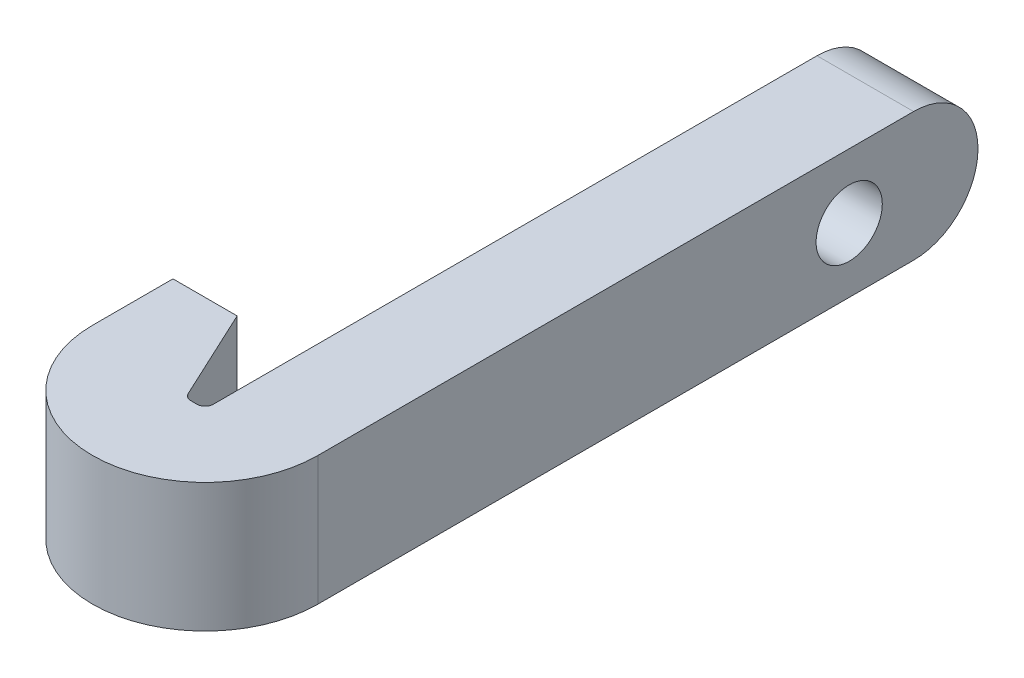
ISO-10303-21;
HEADER;
FILE_DESCRIPTION(('STEP AP214'),'2;1');
FILE_NAME('part.step','',(''),(''),'','','');
FILE_SCHEMA(('AUTOMOTIVE_DESIGN { 1 0 10303 214 1 1 1 1 }'));
ENDSEC;
DATA;
#1=APPLICATION_CONTEXT('core data for automotive mechanical design processes');
#2=APPLICATION_PROTOCOL_DEFINITION('international standard','automotive_design',2000,#1);
#3=PRODUCT_CONTEXT('',#1,'mechanical');
#4=PRODUCT('Part','Part','',(#3));
#5=PRODUCT_RELATED_PRODUCT_CATEGORY('part','',(#4));
#6=PRODUCT_DEFINITION_FORMATION('','',#4);
#7=PRODUCT_DEFINITION_CONTEXT('part definition',#1,'design');
#8=PRODUCT_DEFINITION('design','',#6,#7);
#9=PRODUCT_DEFINITION_SHAPE('','',#8);
#10=(LENGTH_UNIT() NAMED_UNIT(*) SI_UNIT(.MILLI.,.METRE.));
#11=(NAMED_UNIT(*) PLANE_ANGLE_UNIT() SI_UNIT($,.RADIAN.));
#12=(NAMED_UNIT(*) SI_UNIT($,.STERADIAN.) SOLID_ANGLE_UNIT());
#13=UNCERTAINTY_MEASURE_WITH_UNIT(LENGTH_MEASURE(1.E-05),#10,'distance_accuracy_value','');
#14=(GEOMETRIC_REPRESENTATION_CONTEXT(3) GLOBAL_UNCERTAINTY_ASSIGNED_CONTEXT((#13)) GLOBAL_UNIT_ASSIGNED_CONTEXT((#10,
#11,#12)) REPRESENTATION_CONTEXT('',''));
#15=CARTESIAN_POINT('',(0.,0.,0.));
#16=DIRECTION('',(0.,0.,1.));
#17=DIRECTION('',(1.,0.,0.));
#18=AXIS2_PLACEMENT_3D('',#15,#16,#17);
#19=CARTESIAN_POINT('',(-1.5875,3.175,-34.925));
#20=DIRECTION('',(-1.,0.,0.));
#21=DIRECTION('',(0.,0.,1.));
#22=AXIS2_PLACEMENT_3D('',#19,#20,#21);
#23=CYLINDRICAL_SURFACE('',#22,3.175);
#24=DIRECTION('',(-1.,0.,0.));
#25=VECTOR('',#24,1.);
#26=CARTESIAN_POINT('',(0.,0.,-34.925));
#27=LINE('',#26,#25);
#28=CARTESIAN_POINT('',(-1.5875,0.,-34.925));
#29=VERTEX_POINT('',#28);
#30=CARTESIAN_POINT('',(3.175,0.,-34.925));
#31=VERTEX_POINT('',#30);
#32=EDGE_CURVE('E189',#29,#31,#27,.F.);
#33=ORIENTED_EDGE('',*,*,#32,.F.);
#34=CARTESIAN_POINT('',(-1.5875,3.175,-34.925));
#35=DIRECTION('',(1.,0.,0.));
#36=DIRECTION('',(0.,0.,-1.));
#37=AXIS2_PLACEMENT_3D('',#34,#35,#36);
#38=CIRCLE('',#37,3.175);
#39=CARTESIAN_POINT('',(-1.5875,6.35,-34.925));
#40=VERTEX_POINT('',#39);
#41=EDGE_CURVE('E46',#40,#29,#38,.F.);
#42=ORIENTED_EDGE('',*,*,#41,.F.);
#43=DIRECTION('',(1.,0.,0.));
#44=VECTOR('',#43,1.);
#45=CARTESIAN_POINT('',(-1.5875,6.35,-34.925));
#46=LINE('',#45,#44);
#47=CARTESIAN_POINT('',(3.175,6.35,-34.925));
#48=VERTEX_POINT('',#47);
#49=EDGE_CURVE('E192',#48,#40,#46,.F.);
#50=ORIENTED_EDGE('',*,*,#49,.F.);
#51=CARTESIAN_POINT('',(3.175,3.175,-34.925));
#52=DIRECTION('',(-1.,0.,0.));
#53=DIRECTION('',(0.,0.,1.));
#54=AXIS2_PLACEMENT_3D('',#51,#52,#53);
#55=CIRCLE('',#54,3.175);
#56=EDGE_CURVE('E11',#31,#48,#55,.F.);
#57=ORIENTED_EDGE('',*,*,#56,.F.);
#58=EDGE_LOOP('',(#33,#42,#50,#57));
#59=FACE_BOUND('',#58,.T.);
#60=ADVANCED_FACE('F38',(#59),#23,.T.);
#61=CARTESIAN_POINT('',(-2.38125,0.,-5.55625));
#62=DIRECTION('',(0.,-1.,0.));
#63=DIRECTION('',(0.,0.,-1.));
#64=AXIS2_PLACEMENT_3D('',#61,#62,#63);
#65=CYLINDRICAL_SURFACE('',#64,5.55625);
#66=DIRECTION('',(0.,-1.,0.));
#67=VECTOR('',#66,1.);
#68=CARTESIAN_POINT('',(-7.9375,6.35,-5.55625));
#69=LINE('',#68,#67);
#70=CARTESIAN_POINT('',(-7.9375,0.,-5.55625));
#71=VERTEX_POINT('',#70);
#72=CARTESIAN_POINT('',(-7.9375,6.35,-5.55625));
#73=VERTEX_POINT('',#72);
#74=EDGE_CURVE('E179',#71,#73,#69,.F.);
#75=ORIENTED_EDGE('',*,*,#74,.F.);
#76=CARTESIAN_POINT('',(-2.38125,0.,-5.55625));
#77=DIRECTION('',(0.,1.,0.));
#78=DIRECTION('',(0.,0.,1.));
#79=AXIS2_PLACEMENT_3D('',#76,#77,#78);
#80=CIRCLE('',#79,5.55625);
#81=CARTESIAN_POINT('',(3.175,0.,-5.55625));
#82=VERTEX_POINT('',#81);
#83=EDGE_CURVE('E185',#82,#71,#80,.F.);
#84=ORIENTED_EDGE('',*,*,#83,.F.);
#85=DIRECTION('',(0.,-1.,0.));
#86=VECTOR('',#85,1.);
#87=CARTESIAN_POINT('',(3.175,6.35,-5.55625));
#88=LINE('',#87,#86);
#89=CARTESIAN_POINT('',(3.175,6.35,-5.55625));
#90=VERTEX_POINT('',#89);
#91=EDGE_CURVE('E182',#90,#82,#88,.T.);
#92=ORIENTED_EDGE('',*,*,#91,.F.);
#93=CARTESIAN_POINT('',(-2.38125,6.35,-5.55625));
#94=DIRECTION('',(0.,1.,0.));
#95=DIRECTION('',(0.,0.,1.));
#96=AXIS2_PLACEMENT_3D('',#93,#94,#95);
#97=CIRCLE('',#96,5.55625);
#98=EDGE_CURVE('E187',#73,#90,#97,.T.);
#99=ORIENTED_EDGE('',*,*,#98,.F.);
#100=EDGE_LOOP('',(#75,#84,#92,#99));
#101=FACE_BOUND('',#100,.T.);
#102=ADVANCED_FACE('F225',(#101),#65,.T.);
#103=CARTESIAN_POINT('',(3.175,6.35,0.));
#104=DIRECTION('',(-1.,0.,0.));
#105=DIRECTION('',(0.,0.,1.));
#106=AXIS2_PLACEMENT_3D('',#103,#104,#105);
#107=PLANE('',#106);
#108=CARTESIAN_POINT('',(3.175,3.175,-31.75));
#109=DIRECTION('',(1.,0.,0.));
#110=DIRECTION('',(0.,0.,-1.));
#111=AXIS2_PLACEMENT_3D('',#108,#109,#110);
#112=CIRCLE('',#111,1.63194999999999);
#113=CARTESIAN_POINT('',(3.175,3.175,-33.38195));
#114=VERTEX_POINT('',#113);
#115=EDGE_CURVE('E216',#114,#114,#112,.T.);
#116=ORIENTED_EDGE('',*,*,#115,.F.);
#117=EDGE_LOOP('',(#116));
#118=FACE_BOUND('',#117,.T.);
#119=DIRECTION('',(0.,0.,-1.));
#120=VECTOR('',#119,1.);
#121=CARTESIAN_POINT('',(3.175,0.,0.));
#122=LINE('',#121,#120);
#123=EDGE_CURVE('E146',#82,#31,#122,.T.);
#124=ORIENTED_EDGE('',*,*,#123,.T.);
#125=ORIENTED_EDGE('',*,*,#56,.T.);
#126=DIRECTION('',(0.,0.,-1.));
#127=VECTOR('',#126,1.);
#128=CARTESIAN_POINT('',(3.175,6.35,0.));
#129=LINE('',#128,#127);
#130=EDGE_CURVE('E160',#90,#48,#129,.T.);
#131=ORIENTED_EDGE('',*,*,#130,.F.);
#132=ORIENTED_EDGE('',*,*,#91,.T.);
#133=EDGE_LOOP('',(#124,#125,#131,#132));
#134=FACE_BOUND('',#133,.T.);
#135=ADVANCED_FACE('F223',(#118,#134),#107,.F.);
#136=CARTESIAN_POINT('',(-1.5875,6.35,-4.7625));
#137=DIRECTION('',(1.,0.,0.));
#138=DIRECTION('',(0.,0.,-1.));
#139=AXIS2_PLACEMENT_3D('',#136,#137,#138);
#140=PLANE('',#139);
#141=CARTESIAN_POINT('',(-1.5875,3.175,-31.75));
#142=DIRECTION('',(1.,0.,0.));
#143=DIRECTION('',(0.,0.,-1.));
#144=AXIS2_PLACEMENT_3D('',#141,#142,#143);
#145=CIRCLE('',#144,1.63194999999999);
#146=CARTESIAN_POINT('',(-1.5875,3.175,-33.38195));
#147=VERTEX_POINT('',#146);
#148=EDGE_CURVE('E149',#147,#147,#145,.T.);
#149=ORIENTED_EDGE('',*,*,#148,.T.);
#150=EDGE_LOOP('',(#149));
#151=FACE_BOUND('',#150,.T.);
#152=DIRECTION('',(0.,0.,1.));
#153=VECTOR('',#152,1.);
#154=CARTESIAN_POINT('',(-1.5875,6.35,-4.7625));
#155=LINE('',#154,#153);
#156=CARTESIAN_POINT('',(-1.5875,6.35,-5.159375));
#157=VERTEX_POINT('',#156);
#158=EDGE_CURVE('E197',#40,#157,#155,.T.);
#159=ORIENTED_EDGE('',*,*,#158,.F.);
#160=ORIENTED_EDGE('',*,*,#41,.T.);
#161=DIRECTION('',(0.,0.,1.));
#162=VECTOR('',#161,1.);
#163=CARTESIAN_POINT('',(-1.5875,0.,-4.7625));
#164=LINE('',#163,#162);
#165=CARTESIAN_POINT('',(-1.5875,0.,-5.159375));
#166=VERTEX_POINT('',#165);
#167=EDGE_CURVE('E148',#29,#166,#164,.T.);
#168=ORIENTED_EDGE('',*,*,#167,.T.);
#169=DIRECTION('',(0.,-1.,0.));
#170=VECTOR('',#169,1.);
#171=CARTESIAN_POINT('',(-1.5875,6.35,-5.159375));
#172=LINE('',#171,#170);
#173=EDGE_CURVE('E168',#166,#157,#172,.F.);
#174=ORIENTED_EDGE('',*,*,#173,.T.);
#175=EDGE_LOOP('',(#159,#160,#168,#174));
#176=FACE_BOUND('',#175,.T.);
#177=ADVANCED_FACE('F195',(#151,#176),#140,.F.);
#178=CARTESIAN_POINT('',(-2.5527,6.35,-4.7625));
#179=DIRECTION('',(0.,0.,1.));
#180=DIRECTION('',(1.,0.,0.));
#181=AXIS2_PLACEMENT_3D('',#178,#179,#180);
#182=PLANE('',#181);
#183=DIRECTION('',(-1.,0.,0.));
#184=VECTOR('',#183,1.);
#185=CARTESIAN_POINT('',(-2.5527,0.,-4.7625));
#186=LINE('',#185,#184);
#187=CARTESIAN_POINT('',(-1.984375,0.,-4.7625));
#188=VERTEX_POINT('',#187);
#189=CARTESIAN_POINT('',(-2.29986274024202,0.,-4.7625));
#190=VERTEX_POINT('',#189);
#191=EDGE_CURVE('E151',#188,#190,#186,.T.);
#192=ORIENTED_EDGE('',*,*,#191,.T.);
#193=DIRECTION('',(0.,-1.,0.));
#194=VECTOR('',#193,1.);
#195=CARTESIAN_POINT('',(-2.29986274024202,6.35,-4.7625));
#196=LINE('',#195,#194);
#197=CARTESIAN_POINT('',(-2.29986274024202,6.35,-4.7625));
#198=VERTEX_POINT('',#197);
#199=EDGE_CURVE('E166',#190,#198,#196,.F.);
#200=ORIENTED_EDGE('',*,*,#199,.T.);
#201=DIRECTION('',(-1.,0.,0.));
#202=VECTOR('',#201,1.);
#203=CARTESIAN_POINT('',(-2.5527,6.35,-4.7625));
#204=LINE('',#203,#202);
#205=CARTESIAN_POINT('',(-1.984375,6.35,-4.7625));
#206=VERTEX_POINT('',#205);
#207=EDGE_CURVE('E126',#206,#198,#204,.T.);
#208=ORIENTED_EDGE('',*,*,#207,.F.);
#209=DIRECTION('',(0.,-1.,0.));
#210=VECTOR('',#209,1.);
#211=CARTESIAN_POINT('',(-1.984375,0.,-4.7625));
#212=LINE('',#211,#210);
#213=EDGE_CURVE('E163',#206,#188,#212,.T.);
#214=ORIENTED_EDGE('',*,*,#213,.T.);
#215=EDGE_LOOP('',(#192,#200,#208,#214));
#216=FACE_BOUND('',#215,.T.);
#217=ADVANCED_FACE('F209',(#216),#182,.F.);
#218=CARTESIAN_POINT('',(-4.77349022196314,6.35,-9.525));
#219=DIRECTION('',(-0.906307787036653,0.,0.422618261740694));
#220=DIRECTION('',(0.422618261740694,0.,0.906307787036653));
#221=AXIS2_PLACEMENT_3D('',#218,#219,#220);
#222=PLANE('',#221);
#223=DIRECTION('',(-0.422618261740694,0.,-0.906307787036653));
#224=VECTOR('',#223,1.);
#225=CARTESIAN_POINT('',(-4.77349022196314,6.35,-9.525));
#226=LINE('',#225,#224);
#227=CARTESIAN_POINT('',(-2.65955364322219,6.35,-4.99164837737166));
#228=VERTEX_POINT('',#227);
#229=CARTESIAN_POINT('',(-4.77349022196314,6.35,-9.525));
#230=VERTEX_POINT('',#229);
#231=EDGE_CURVE('E112',#228,#230,#226,.T.);
#232=ORIENTED_EDGE('',*,*,#231,.F.);
#233=DIRECTION('',(0.,-1.,0.));
#234=VECTOR('',#233,1.);
#235=CARTESIAN_POINT('',(-2.65955364322219,0.,-4.99164837737166));
#236=LINE('',#235,#234);
#237=CARTESIAN_POINT('',(-2.65955364322219,0.,-4.99164837737166));
#238=VERTEX_POINT('',#237);
#239=EDGE_CURVE('E135',#228,#238,#236,.T.);
#240=ORIENTED_EDGE('',*,*,#239,.T.);
#241=DIRECTION('',(-0.422618261740694,0.,-0.906307787036653));
#242=VECTOR('',#241,1.);
#243=CARTESIAN_POINT('',(-4.77349022196314,0.,-9.525));
#244=LINE('',#243,#242);
#245=CARTESIAN_POINT('',(-4.77349022196314,0.,-9.525));
#246=VERTEX_POINT('',#245);
#247=EDGE_CURVE('E132',#238,#246,#244,.T.);
#248=ORIENTED_EDGE('',*,*,#247,.T.);
#249=DIRECTION('',(0.,-1.,0.));
#250=VECTOR('',#249,1.);
#251=CARTESIAN_POINT('',(-4.77349022196314,6.35,-9.525));
#252=LINE('',#251,#250);
#253=EDGE_CURVE('E129',#230,#246,#252,.T.);
#254=ORIENTED_EDGE('',*,*,#253,.F.);
#255=EDGE_LOOP('',(#232,#240,#248,#254));
#256=FACE_BOUND('',#255,.T.);
#257=ADVANCED_FACE('F130',(#256),#222,.F.);
#258=CARTESIAN_POINT('',(-7.9375,6.35,-9.525));
#259=DIRECTION('',(0.,0.,1.));
#260=DIRECTION('',(1.,0.,0.));
#261=AXIS2_PLACEMENT_3D('',#258,#259,#260);
#262=PLANE('',#261);
#263=DIRECTION('',(-1.,0.,0.));
#264=VECTOR('',#263,1.);
#265=CARTESIAN_POINT('',(-7.9375,0.,-9.525));
#266=LINE('',#265,#264);
#267=CARTESIAN_POINT('',(-7.9375,0.,-9.525));
#268=VERTEX_POINT('',#267);
#269=EDGE_CURVE('E155',#246,#268,#266,.T.);
#270=ORIENTED_EDGE('',*,*,#269,.T.);
#271=DIRECTION('',(0.,-1.,0.));
#272=VECTOR('',#271,1.);
#273=CARTESIAN_POINT('',(-7.9375,6.35,-9.525));
#274=LINE('',#273,#272);
#275=CARTESIAN_POINT('',(-7.9375,6.35,-9.525));
#276=VERTEX_POINT('',#275);
#277=EDGE_CURVE('E136',#276,#268,#274,.T.);
#278=ORIENTED_EDGE('',*,*,#277,.F.);
#279=DIRECTION('',(-1.,0.,0.));
#280=VECTOR('',#279,1.);
#281=CARTESIAN_POINT('',(-7.9375,6.35,-9.525));
#282=LINE('',#281,#280);
#283=EDGE_CURVE('E118',#230,#276,#282,.T.);
#284=ORIENTED_EDGE('',*,*,#283,.F.);
#285=ORIENTED_EDGE('',*,*,#253,.T.);
#286=EDGE_LOOP('',(#270,#278,#284,#285));
#287=FACE_BOUND('',#286,.T.);
#288=ADVANCED_FACE('F138',(#287),#262,.F.);
#289=CARTESIAN_POINT('',(-7.9375,6.35,0.));
#290=DIRECTION('',(1.,0.,0.));
#291=DIRECTION('',(0.,0.,-1.));
#292=AXIS2_PLACEMENT_3D('',#289,#290,#291);
#293=PLANE('',#292);
#294=DIRECTION('',(0.,0.,1.));
#295=VECTOR('',#294,1.);
#296=CARTESIAN_POINT('',(-7.9375,0.,0.));
#297=LINE('',#296,#295);
#298=EDGE_CURVE('E157',#268,#71,#297,.T.);
#299=ORIENTED_EDGE('',*,*,#298,.T.);
#300=ORIENTED_EDGE('',*,*,#74,.T.);
#301=DIRECTION('',(0.,0.,1.));
#302=VECTOR('',#301,1.);
#303=CARTESIAN_POINT('',(-7.9375,6.35,0.));
#304=LINE('',#303,#302);
#305=EDGE_CURVE('E141',#276,#73,#304,.T.);
#306=ORIENTED_EDGE('',*,*,#305,.F.);
#307=ORIENTED_EDGE('',*,*,#277,.T.);
#308=EDGE_LOOP('',(#299,#300,#306,#307));
#309=FACE_BOUND('',#308,.T.);
#310=ADVANCED_FACE('F232',(#309),#293,.F.);
#311=CARTESIAN_POINT('',(0.,6.35,0.));
#312=DIRECTION('',(0.,1.,0.));
#313=DIRECTION('',(0.,0.,1.));
#314=AXIS2_PLACEMENT_3D('',#311,#312,#313);
#315=PLANE('',#314);
#316=ORIENTED_EDGE('',*,*,#130,.T.);
#317=ORIENTED_EDGE('',*,*,#49,.T.);
#318=ORIENTED_EDGE('',*,*,#158,.T.);
#319=CARTESIAN_POINT('',(-1.984375,6.35,-5.159375));
#320=DIRECTION('',(0.,1.,0.));
#321=DIRECTION('',(0.,0.,1.));
#322=AXIS2_PLACEMENT_3D('',#319,#320,#321);
#323=CIRCLE('',#322,0.396875);
#324=EDGE_CURVE('E177',#157,#206,#323,.F.);
#325=ORIENTED_EDGE('',*,*,#324,.T.);
#326=ORIENTED_EDGE('',*,*,#207,.T.);
#327=CARTESIAN_POINT('',(-2.29986274024202,6.35,-5.159375));
#328=DIRECTION('',(0.,1.,0.));
#329=DIRECTION('',(0.,0.,1.));
#330=AXIS2_PLACEMENT_3D('',#327,#328,#329);
#331=CIRCLE('',#330,0.396875);
#332=EDGE_CURVE('E122',#198,#228,#331,.F.);
#333=ORIENTED_EDGE('',*,*,#332,.T.);
#334=ORIENTED_EDGE('',*,*,#231,.T.);
#335=ORIENTED_EDGE('',*,*,#283,.T.);
#336=ORIENTED_EDGE('',*,*,#305,.T.);
#337=ORIENTED_EDGE('',*,*,#98,.T.);
#338=EDGE_LOOP('',(#316,#317,#318,#325,#326,#333,#334,#335,#336,#337));
#339=FACE_BOUND('',#338,.T.);
#340=ADVANCED_FACE('F115',(#339),#315,.T.);
#341=CARTESIAN_POINT('',(0.,0.,0.));
#342=DIRECTION('',(0.,1.,0.));
#343=DIRECTION('',(0.,0.,1.));
#344=AXIS2_PLACEMENT_3D('',#341,#342,#343);
#345=PLANE('',#344);
#346=ORIENTED_EDGE('',*,*,#167,.F.);
#347=ORIENTED_EDGE('',*,*,#32,.T.);
#348=ORIENTED_EDGE('',*,*,#123,.F.);
#349=ORIENTED_EDGE('',*,*,#83,.T.);
#350=ORIENTED_EDGE('',*,*,#298,.F.);
#351=ORIENTED_EDGE('',*,*,#269,.F.);
#352=ORIENTED_EDGE('',*,*,#247,.F.);
#353=CARTESIAN_POINT('',(-2.29986274024202,0.,-5.159375));
#354=DIRECTION('',(0.,1.,0.));
#355=DIRECTION('',(0.,0.,1.));
#356=AXIS2_PLACEMENT_3D('',#353,#354,#355);
#357=CIRCLE('',#356,0.396875);
#358=EDGE_CURVE('E171',#238,#190,#357,.T.);
#359=ORIENTED_EDGE('',*,*,#358,.T.);
#360=ORIENTED_EDGE('',*,*,#191,.F.);
#361=CARTESIAN_POINT('',(-1.984375,0.,-5.159375));
#362=DIRECTION('',(0.,1.,0.));
#363=DIRECTION('',(0.,0.,1.));
#364=AXIS2_PLACEMENT_3D('',#361,#362,#363);
#365=CIRCLE('',#364,0.396875);
#366=EDGE_CURVE('E174',#188,#166,#365,.T.);
#367=ORIENTED_EDGE('',*,*,#366,.T.);
#368=EDGE_LOOP('',(#346,#347,#348,#349,#350,#351,#352,#359,#360,#367));
#369=FACE_BOUND('',#368,.T.);
#370=ADVANCED_FACE('F200',(#369),#345,.F.);
#371=CARTESIAN_POINT('',(-2.29986274024202,6.35,-5.159375));
#372=DIRECTION('',(0.,1.,0.));
#373=DIRECTION('',(0.,0.,1.));
#374=AXIS2_PLACEMENT_3D('',#371,#372,#373);
#375=CYLINDRICAL_SURFACE('',#374,0.396875);
#376=ORIENTED_EDGE('',*,*,#332,.F.);
#377=ORIENTED_EDGE('',*,*,#199,.F.);
#378=ORIENTED_EDGE('',*,*,#358,.F.);
#379=ORIENTED_EDGE('',*,*,#239,.F.);
#380=EDGE_LOOP('',(#376,#377,#378,#379));
#381=FACE_BOUND('',#380,.T.);
#382=ADVANCED_FACE('F254',(#381),#375,.F.);
#383=CARTESIAN_POINT('',(-1.984375,6.35,-5.159375));
#384=DIRECTION('',(0.,1.,0.));
#385=DIRECTION('',(0.,0.,1.));
#386=AXIS2_PLACEMENT_3D('',#383,#384,#385);
#387=CYLINDRICAL_SURFACE('',#386,0.396875);
#388=ORIENTED_EDGE('',*,*,#324,.F.);
#389=ORIENTED_EDGE('',*,*,#173,.F.);
#390=ORIENTED_EDGE('',*,*,#366,.F.);
#391=ORIENTED_EDGE('',*,*,#213,.F.);
#392=EDGE_LOOP('',(#388,#389,#390,#391));
#393=FACE_BOUND('',#392,.T.);
#394=ADVANCED_FACE('F206',(#393),#387,.F.);
#395=CARTESIAN_POINT('',(3.175,3.175,-31.75));
#396=DIRECTION('',(1.,0.,0.));
#397=DIRECTION('',(0.,0.,-1.));
#398=AXIS2_PLACEMENT_3D('',#395,#396,#397);
#399=CYLINDRICAL_SURFACE('',#398,1.63194999999999);
#400=ORIENTED_EDGE('',*,*,#115,.T.);
#401=EDGE_LOOP('',(#400));
#402=FACE_BOUND('',#401,.T.);
#403=ORIENTED_EDGE('',*,*,#148,.F.);
#404=EDGE_LOOP('',(#403));
#405=FACE_BOUND('',#404,.T.);
#406=ADVANCED_FACE('F220',(#402,#405),#399,.F.);
#407=CLOSED_SHELL('',(#60,#102,#135,#177,#217,#257,#288,#310,#340,#370,#382,#394,#406));
#408=MANIFOLD_SOLID_BREP('B2',#407);
#409=ADVANCED_BREP_SHAPE_REPRESENTATION('',(#18,#408),#14);
#410=SHAPE_DEFINITION_REPRESENTATION(#9,#409);
ENDSEC;
END-ISO-10303-21;
